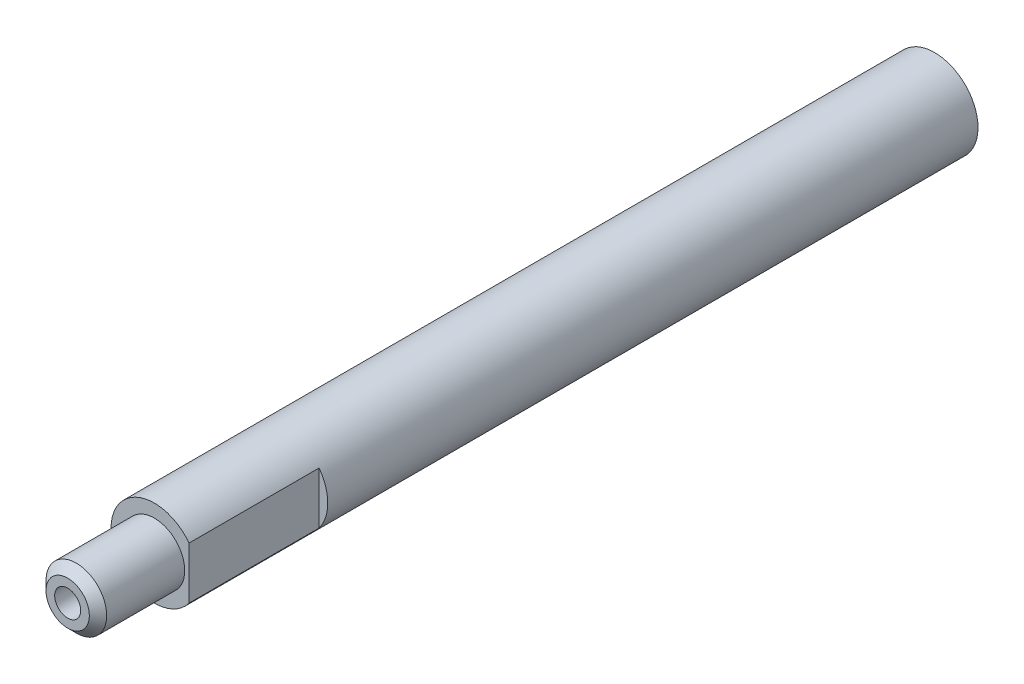
ISO-10303-21;
HEADER;
FILE_DESCRIPTION(('STEP AP214'),'2;1');
FILE_NAME('part.step','',(''),(''),'','','');
FILE_SCHEMA(('AUTOMOTIVE_DESIGN { 1 0 10303 214 1 1 1 1 }'));
ENDSEC;
DATA;
#1=APPLICATION_CONTEXT('core data for automotive mechanical design processes');
#2=APPLICATION_PROTOCOL_DEFINITION('international standard','automotive_design',2000,#1);
#3=PRODUCT_CONTEXT('',#1,'mechanical');
#4=PRODUCT('Part','Part','',(#3));
#5=PRODUCT_RELATED_PRODUCT_CATEGORY('part','',(#4));
#6=PRODUCT_DEFINITION_FORMATION('','',#4);
#7=PRODUCT_DEFINITION_CONTEXT('part definition',#1,'design');
#8=PRODUCT_DEFINITION('design','',#6,#7);
#9=PRODUCT_DEFINITION_SHAPE('','',#8);
#10=(LENGTH_UNIT() NAMED_UNIT(*) SI_UNIT(.MILLI.,.METRE.));
#11=(NAMED_UNIT(*) PLANE_ANGLE_UNIT() SI_UNIT($,.RADIAN.));
#12=(NAMED_UNIT(*) SI_UNIT($,.STERADIAN.) SOLID_ANGLE_UNIT());
#13=UNCERTAINTY_MEASURE_WITH_UNIT(LENGTH_MEASURE(1.E-05),#10,'distance_accuracy_value','');
#14=(GEOMETRIC_REPRESENTATION_CONTEXT(3) GLOBAL_UNCERTAINTY_ASSIGNED_CONTEXT((#13)) GLOBAL_UNIT_ASSIGNED_CONTEXT((#10,
#11,#12)) REPRESENTATION_CONTEXT('',''));
#15=CARTESIAN_POINT('',(0.,0.,0.));
#16=DIRECTION('',(0.,0.,1.));
#17=DIRECTION('',(1.,0.,0.));
#18=AXIS2_PLACEMENT_3D('',#15,#16,#17);
#19=CARTESIAN_POINT('',(0.,0.,100.));
#20=DIRECTION('',(0.,0.,-1.));
#21=DIRECTION('',(-1.,0.,0.));
#22=AXIS2_PLACEMENT_3D('',#19,#20,#21);
#23=CYLINDRICAL_SURFACE('',#22,5.);
#24=CARTESIAN_POINT('',(0.,0.,90.));
#25=DIRECTION('',(0.,0.,1.));
#26=DIRECTION('',(1.,0.,0.));
#27=AXIS2_PLACEMENT_3D('',#24,#25,#26);
#28=CIRCLE('',#27,5.);
#29=CARTESIAN_POINT('',(4.,3.,90.));
#30=VERTEX_POINT('',#29);
#31=CARTESIAN_POINT('',(4.,-3.,90.));
#32=VERTEX_POINT('',#31);
#33=EDGE_CURVE('E85',#30,#32,#28,.T.);
#34=ORIENTED_EDGE('',*,*,#33,.F.);
#35=DIRECTION('',(0.,0.,1.));
#36=VECTOR('',#35,1.);
#37=CARTESIAN_POINT('',(4.,3.,75.));
#38=LINE('',#37,#36);
#39=CARTESIAN_POINT('',(4.,3.,75.));
#40=VERTEX_POINT('',#39);
#41=EDGE_CURVE('E63',#40,#30,#38,.T.);
#42=ORIENTED_EDGE('',*,*,#41,.F.);
#43=CARTESIAN_POINT('',(0.,0.,75.));
#44=DIRECTION('',(0.,0.,1.));
#45=DIRECTION('',(1.,0.,0.));
#46=AXIS2_PLACEMENT_3D('',#43,#44,#45);
#47=CIRCLE('',#46,5.);
#48=CARTESIAN_POINT('',(4.,-3.,75.));
#49=VERTEX_POINT('',#48);
#50=EDGE_CURVE('E79',#49,#40,#47,.T.);
#51=ORIENTED_EDGE('',*,*,#50,.F.);
#52=DIRECTION('',(0.,0.,1.));
#53=VECTOR('',#52,1.);
#54=CARTESIAN_POINT('',(4.,-3.,75.));
#55=LINE('',#54,#53);
#56=EDGE_CURVE('E69',#49,#32,#55,.T.);
#57=ORIENTED_EDGE('',*,*,#56,.T.);
#58=EDGE_LOOP('',(#34,#42,#51,#57));
#59=FACE_BOUND('',#58,.T.);
#60=CARTESIAN_POINT('',(0.,0.,0.));
#61=DIRECTION('',(0.,0.,1.));
#62=DIRECTION('',(1.,0.,0.));
#63=AXIS2_PLACEMENT_3D('',#60,#61,#62);
#64=CIRCLE('',#63,5.);
#65=CARTESIAN_POINT('',(5.,0.,0.));
#66=VERTEX_POINT('',#65);
#67=EDGE_CURVE('E90',#66,#66,#64,.T.);
#68=ORIENTED_EDGE('',*,*,#67,.T.);
#69=EDGE_LOOP('',(#68));
#70=FACE_BOUND('',#69,.T.);
#71=ADVANCED_FACE('F48',(#59,#70),#23,.T.);
#72=CARTESIAN_POINT('',(0.,0.,0.));
#73=DIRECTION('',(0.,0.,1.));
#74=DIRECTION('',(1.,0.,0.));
#75=AXIS2_PLACEMENT_3D('',#72,#73,#74);
#76=PLANE('',#75);
#77=CARTESIAN_POINT('',(0.,0.,0.));
#78=DIRECTION('',(0.,0.,-1.));
#79=DIRECTION('',(-1.,0.,0.));
#80=AXIS2_PLACEMENT_3D('',#77,#78,#79);
#81=CIRCLE('',#80,2.);
#82=CARTESIAN_POINT('',(-2.,0.,0.));
#83=VERTEX_POINT('',#82);
#84=EDGE_CURVE('E150',#83,#83,#81,.T.);
#85=ORIENTED_EDGE('',*,*,#84,.F.);
#86=EDGE_LOOP('',(#85));
#87=FACE_BOUND('',#86,.T.);
#88=ORIENTED_EDGE('',*,*,#67,.F.);
#89=EDGE_LOOP('',(#88));
#90=FACE_BOUND('',#89,.T.);
#91=ADVANCED_FACE('F118',(#87,#90),#76,.F.);
#92=CARTESIAN_POINT('',(0.,0.,90.));
#93=DIRECTION('',(0.,0.,1.));
#94=DIRECTION('',(1.,0.,0.));
#95=AXIS2_PLACEMENT_3D('',#92,#93,#94);
#96=PLANE('',#95);
#97=DIRECTION('',(0.,-1.,0.));
#98=VECTOR('',#97,1.);
#99=CARTESIAN_POINT('',(4.,3.,90.));
#100=LINE('',#99,#98);
#101=EDGE_CURVE('E74',#30,#32,#100,.T.);
#102=ORIENTED_EDGE('',*,*,#101,.F.);
#103=ORIENTED_EDGE('',*,*,#33,.T.);
#104=EDGE_LOOP('',(#102,#103));
#105=FACE_BOUND('',#104,.T.);
#106=CARTESIAN_POINT('',(0.,0.,90.));
#107=DIRECTION('',(0.,0.,1.));
#108=DIRECTION('',(1.,0.,0.));
#109=AXIS2_PLACEMENT_3D('',#106,#107,#108);
#110=CIRCLE('',#109,3.5);
#111=CARTESIAN_POINT('',(3.5,0.,90.));
#112=VERTEX_POINT('',#111);
#113=EDGE_CURVE('E91',#112,#112,#110,.T.);
#114=ORIENTED_EDGE('',*,*,#113,.F.);
#115=EDGE_LOOP('',(#114));
#116=FACE_BOUND('',#115,.T.);
#117=ADVANCED_FACE('F88',(#105,#116),#96,.T.);
#118=CARTESIAN_POINT('',(0.,0.,90.));
#119=DIRECTION('',(0.,0.,1.));
#120=DIRECTION('',(1.,0.,0.));
#121=AXIS2_PLACEMENT_3D('',#118,#119,#120);
#122=CYLINDRICAL_SURFACE('',#121,3.5);
#123=CARTESIAN_POINT('',(0.,0.,99.));
#124=DIRECTION('',(0.,0.,1.));
#125=DIRECTION('',(1.,0.,0.));
#126=AXIS2_PLACEMENT_3D('',#123,#124,#125);
#127=CIRCLE('',#126,3.5);
#128=CARTESIAN_POINT('',(3.5,0.,99.));
#129=VERTEX_POINT('',#128);
#130=EDGE_CURVE('E14',#129,#129,#127,.F.);
#131=ORIENTED_EDGE('',*,*,#130,.T.);
#132=EDGE_LOOP('',(#131));
#133=FACE_BOUND('',#132,.T.);
#134=ORIENTED_EDGE('',*,*,#113,.T.);
#135=EDGE_LOOP('',(#134));
#136=FACE_BOUND('',#135,.T.);
#137=ADVANCED_FACE('F127',(#133,#136),#122,.T.);
#138=CARTESIAN_POINT('',(0.,0.,100.));
#139=DIRECTION('',(0.,0.,1.));
#140=DIRECTION('',(1.,0.,0.));
#141=AXIS2_PLACEMENT_3D('',#138,#139,#140);
#142=PLANE('',#141);
#143=CARTESIAN_POINT('',(0.,0.,100.));
#144=DIRECTION('',(0.,0.,1.));
#145=DIRECTION('',(1.,0.,0.));
#146=AXIS2_PLACEMENT_3D('',#143,#144,#145);
#147=CIRCLE('',#146,2.5);
#148=CARTESIAN_POINT('',(2.5,0.,100.));
#149=VERTEX_POINT('',#148);
#150=EDGE_CURVE('E56',#149,#149,#147,.T.);
#151=ORIENTED_EDGE('',*,*,#150,.T.);
#152=EDGE_LOOP('',(#151));
#153=FACE_BOUND('',#152,.T.);
#154=CARTESIAN_POINT('',(0.,0.,100.));
#155=DIRECTION('',(0.,0.,1.));
#156=DIRECTION('',(1.,0.,0.));
#157=AXIS2_PLACEMENT_3D('',#154,#155,#156);
#158=CIRCLE('',#157,1.5);
#159=CARTESIAN_POINT('',(1.5,0.,100.));
#160=VERTEX_POINT('',#159);
#161=EDGE_CURVE('E86',#160,#160,#158,.T.);
#162=ORIENTED_EDGE('',*,*,#161,.F.);
#163=EDGE_LOOP('',(#162));
#164=FACE_BOUND('',#163,.T.);
#165=ADVANCED_FACE('F101',(#153,#164),#142,.T.);
#166=CARTESIAN_POINT('',(0.,0.,90.));
#167=DIRECTION('',(0.,0.,1.));
#168=DIRECTION('',(1.,0.,0.));
#169=AXIS2_PLACEMENT_3D('',#166,#167,#168);
#170=CYLINDRICAL_SURFACE('',#169,1.5);
#171=CARTESIAN_POINT('',(0.,0.,90.));
#172=DIRECTION('',(0.,0.,1.));
#173=DIRECTION('',(1.,0.,0.));
#174=AXIS2_PLACEMENT_3D('',#171,#172,#173);
#175=CIRCLE('',#174,1.5);
#176=CARTESIAN_POINT('',(1.5,0.,90.));
#177=VERTEX_POINT('',#176);
#178=EDGE_CURVE('E96',#177,#177,#175,.T.);
#179=ORIENTED_EDGE('',*,*,#178,.F.);
#180=EDGE_LOOP('',(#179));
#181=FACE_BOUND('',#180,.T.);
#182=ORIENTED_EDGE('',*,*,#161,.T.);
#183=EDGE_LOOP('',(#182));
#184=FACE_BOUND('',#183,.T.);
#185=ADVANCED_FACE('F113',(#181,#184),#170,.F.);
#186=CARTESIAN_POINT('',(0.,0.,90.));
#187=DIRECTION('',(0.,0.,1.));
#188=DIRECTION('',(1.,0.,0.));
#189=AXIS2_PLACEMENT_3D('',#186,#187,#188);
#190=PLANE('',#189);
#191=ORIENTED_EDGE('',*,*,#178,.T.);
#192=EDGE_LOOP('',(#191));
#193=FACE_BOUND('',#192,.T.);
#194=ADVANCED_FACE('F105',(#193),#190,.T.);
#195=CARTESIAN_POINT('',(0.,0.,100.));
#196=DIRECTION('',(0.,0.,-1.));
#197=DIRECTION('',(-1.,0.,0.));
#198=AXIS2_PLACEMENT_3D('',#195,#196,#197);
#199=CONICAL_SURFACE('',#198,2.5,0.785398163397447);
#200=ORIENTED_EDGE('',*,*,#130,.F.);
#201=EDGE_LOOP('',(#200));
#202=FACE_BOUND('',#201,.T.);
#203=ORIENTED_EDGE('',*,*,#150,.F.);
#204=EDGE_LOOP('',(#203));
#205=FACE_BOUND('',#204,.T.);
#206=ADVANCED_FACE('F50',(#202,#205),#199,.T.);
#207=CARTESIAN_POINT('',(4.,3.,75.));
#208=DIRECTION('',(-1.,0.,0.));
#209=DIRECTION('',(0.,0.,1.));
#210=AXIS2_PLACEMENT_3D('',#207,#208,#209);
#211=PLANE('',#210);
#212=ORIENTED_EDGE('',*,*,#101,.T.);
#213=ORIENTED_EDGE('',*,*,#56,.F.);
#214=DIRECTION('',(0.,-1.,0.));
#215=VECTOR('',#214,1.);
#216=CARTESIAN_POINT('',(4.,3.,75.));
#217=LINE('',#216,#215);
#218=EDGE_CURVE('E156',#40,#49,#217,.T.);
#219=ORIENTED_EDGE('',*,*,#218,.F.);
#220=ORIENTED_EDGE('',*,*,#41,.T.);
#221=EDGE_LOOP('',(#212,#213,#219,#220));
#222=FACE_BOUND('',#221,.T.);
#223=ADVANCED_FACE('F75',(#222),#211,.F.);
#224=CARTESIAN_POINT('',(0.,0.,75.));
#225=DIRECTION('',(0.,0.,1.));
#226=DIRECTION('',(1.,0.,0.));
#227=AXIS2_PLACEMENT_3D('',#224,#225,#226);
#228=PLANE('',#227);
#229=ORIENTED_EDGE('',*,*,#50,.T.);
#230=ORIENTED_EDGE('',*,*,#218,.T.);
#231=EDGE_LOOP('',(#229,#230));
#232=FACE_BOUND('',#231,.T.);
#233=ADVANCED_FACE('F111',(#232),#228,.T.);
#234=CARTESIAN_POINT('',(0.,0.,20.));
#235=DIRECTION('',(0.,0.,-1.));
#236=DIRECTION('',(-1.,0.,0.));
#237=AXIS2_PLACEMENT_3D('',#234,#235,#236);
#238=CYLINDRICAL_SURFACE('',#237,2.);
#239=CARTESIAN_POINT('',(0.,0.,20.));
#240=DIRECTION('',(0.,0.,-1.));
#241=DIRECTION('',(-1.,0.,0.));
#242=AXIS2_PLACEMENT_3D('',#239,#240,#241);
#243=CIRCLE('',#242,2.);
#244=CARTESIAN_POINT('',(-2.,0.,20.));
#245=VERTEX_POINT('',#244);
#246=EDGE_CURVE('E80',#245,#245,#243,.T.);
#247=ORIENTED_EDGE('',*,*,#246,.F.);
#248=EDGE_LOOP('',(#247));
#249=FACE_BOUND('',#248,.T.);
#250=ORIENTED_EDGE('',*,*,#84,.T.);
#251=EDGE_LOOP('',(#250));
#252=FACE_BOUND('',#251,.T.);
#253=ADVANCED_FACE('F138',(#249,#252),#238,.F.);
#254=CARTESIAN_POINT('',(0.,0.,20.));
#255=DIRECTION('',(0.,0.,-1.));
#256=DIRECTION('',(-1.,0.,0.));
#257=AXIS2_PLACEMENT_3D('',#254,#255,#256);
#258=PLANE('',#257);
#259=ORIENTED_EDGE('',*,*,#246,.T.);
#260=EDGE_LOOP('',(#259));
#261=FACE_BOUND('',#260,.T.);
#262=ADVANCED_FACE('F142',(#261),#258,.T.);
#263=CLOSED_SHELL('',(#71,#91,#117,#137,#165,#185,#194,#206,#223,#233,#253,#262));
#264=MANIFOLD_SOLID_BREP('B2',#263);
#265=ADVANCED_BREP_SHAPE_REPRESENTATION('',(#18,#264),#14);
#266=SHAPE_DEFINITION_REPRESENTATION(#9,#265);
ENDSEC;
END-ISO-10303-21;
